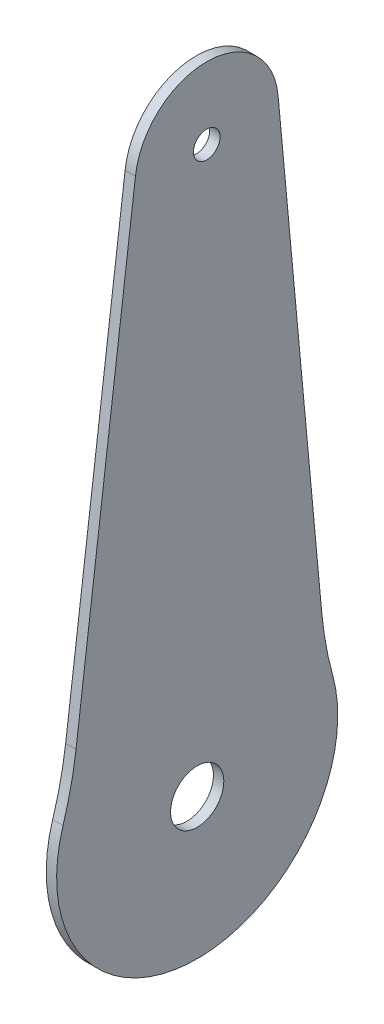
ISO-10303-21;
HEADER;
FILE_DESCRIPTION(('STEP AP214'),'2;1');
FILE_NAME('part.step','',(''),(''),'','','');
FILE_SCHEMA(('AUTOMOTIVE_DESIGN { 1 0 10303 214 1 1 1 1 }'));
ENDSEC;
DATA;
#1=APPLICATION_CONTEXT('core data for automotive mechanical design processes');
#2=APPLICATION_PROTOCOL_DEFINITION('international standard','automotive_design',2000,#1);
#3=PRODUCT_CONTEXT('',#1,'mechanical');
#4=PRODUCT('Part','Part','',(#3));
#5=PRODUCT_RELATED_PRODUCT_CATEGORY('part','',(#4));
#6=PRODUCT_DEFINITION_FORMATION('','',#4);
#7=PRODUCT_DEFINITION_CONTEXT('part definition',#1,'design');
#8=PRODUCT_DEFINITION('design','',#6,#7);
#9=PRODUCT_DEFINITION_SHAPE('','',#8);
#10=(LENGTH_UNIT() NAMED_UNIT(*) SI_UNIT(.MILLI.,.METRE.));
#11=(NAMED_UNIT(*) PLANE_ANGLE_UNIT() SI_UNIT($,.RADIAN.));
#12=(NAMED_UNIT(*) SI_UNIT($,.STERADIAN.) SOLID_ANGLE_UNIT());
#13=UNCERTAINTY_MEASURE_WITH_UNIT(LENGTH_MEASURE(1.E-05),#10,'distance_accuracy_value','');
#14=(GEOMETRIC_REPRESENTATION_CONTEXT(3) GLOBAL_UNCERTAINTY_ASSIGNED_CONTEXT((#13)) GLOBAL_UNIT_ASSIGNED_CONTEXT((#10,
#11,#12)) REPRESENTATION_CONTEXT('',''));
#15=CARTESIAN_POINT('',(0.,0.,0.));
#16=DIRECTION('',(0.,0.,1.));
#17=DIRECTION('',(1.,0.,0.));
#18=AXIS2_PLACEMENT_3D('',#15,#16,#17);
#19=CARTESIAN_POINT('',(1.5,-14.5197265267647,67.1222965585789));
#20=DIRECTION('',(-1.,0.,0.));
#21=DIRECTION('',(0.,0.,1.));
#22=AXIS2_PLACEMENT_3D('',#19,#20,#21);
#23=CYLINDRICAL_SURFACE('',#22,50.);
#24=CARTESIAN_POINT('',(0.,-14.5197265267647,67.1222965585789));
#25=DIRECTION('',(1.,0.,0.));
#26=DIRECTION('',(0.,0.,-1.));
#27=AXIS2_PLACEMENT_3D('',#24,#25,#26);
#28=CIRCLE('',#27,50.);
#29=CARTESIAN_POINT('',(0.,-29.4464687082596,19.4023597622337));
#30=VERTEX_POINT('',#29);
#31=CARTESIAN_POINT('',(0.,-20.8371614377476,17.5230020460004));
#32=VERTEX_POINT('',#31);
#33=EDGE_CURVE('E123',#30,#32,#28,.T.);
#34=ORIENTED_EDGE('',*,*,#33,.F.);
#35=DIRECTION('',(-1.,0.,0.));
#36=VECTOR('',#35,1.);
#37=CARTESIAN_POINT('',(1.5,-29.4464687082596,19.4023597622337));
#38=LINE('',#37,#36);
#39=CARTESIAN_POINT('',(1.5,-29.4464687082596,19.4023597622337));
#40=VERTEX_POINT('',#39);
#41=EDGE_CURVE('E11',#40,#30,#38,.T.);
#42=ORIENTED_EDGE('',*,*,#41,.F.);
#43=CARTESIAN_POINT('',(1.5,-14.5197265267647,67.1222965585789));
#44=DIRECTION('',(1.,0.,0.));
#45=DIRECTION('',(0.,0.,-1.));
#46=AXIS2_PLACEMENT_3D('',#43,#44,#45);
#47=CIRCLE('',#46,50.);
#48=CARTESIAN_POINT('',(1.5,-20.8371614377476,17.5230020460004));
#49=VERTEX_POINT('',#48);
#50=EDGE_CURVE('E142',#40,#49,#47,.T.);
#51=ORIENTED_EDGE('',*,*,#50,.T.);
#52=DIRECTION('',(-1.,0.,0.));
#53=VECTOR('',#52,1.);
#54=CARTESIAN_POINT('',(1.5,-20.8371614377476,17.5230020460004));
#55=LINE('',#54,#53);
#56=EDGE_CURVE('E78',#49,#32,#55,.T.);
#57=ORIENTED_EDGE('',*,*,#56,.T.);
#58=EDGE_LOOP('',(#34,#42,#51,#57));
#59=FACE_BOUND('',#58,.T.);
#60=ADVANCED_FACE('F34',(#59),#23,.F.);
#61=CARTESIAN_POINT('',(1.5,-35.5155048664515,0.));
#62=DIRECTION('',(-1.,0.,0.));
#63=DIRECTION('',(0.,0.,1.));
#64=AXIS2_PLACEMENT_3D('',#61,#62,#63);
#65=CYLINDRICAL_SURFACE('',#64,20.3294063915449);
#66=CARTESIAN_POINT('',(0.,-35.5155048664515,0.));
#67=DIRECTION('',(1.,0.,0.));
#68=DIRECTION('',(0.,0.,-1.));
#69=AXIS2_PLACEMENT_3D('',#66,#67,#68);
#70=CIRCLE('',#69,20.3294063915449);
#71=CARTESIAN_POINT('',(0.,-30.1098500353034,-19.5975421948537));
#72=VERTEX_POINT('',#71);
#73=EDGE_CURVE('E126',#30,#72,#70,.T.);
#74=ORIENTED_EDGE('',*,*,#73,.T.);
#75=DIRECTION('',(-1.,0.,0.));
#76=VECTOR('',#75,1.);
#77=CARTESIAN_POINT('',(1.5,-30.1098500353034,-19.5975421948537));
#78=LINE('',#77,#76);
#79=CARTESIAN_POINT('',(1.5,-30.1098500353034,-19.5975421948537));
#80=VERTEX_POINT('',#79);
#81=EDGE_CURVE('E42',#80,#72,#78,.T.);
#82=ORIENTED_EDGE('',*,*,#81,.F.);
#83=CARTESIAN_POINT('',(1.5,-35.5155048664515,0.));
#84=DIRECTION('',(1.,0.,0.));
#85=DIRECTION('',(0.,0.,-1.));
#86=AXIS2_PLACEMENT_3D('',#83,#84,#85);
#87=CIRCLE('',#86,20.3294063915449);
#88=EDGE_CURVE('E112',#40,#80,#87,.T.);
#89=ORIENTED_EDGE('',*,*,#88,.F.);
#90=ORIENTED_EDGE('',*,*,#41,.T.);
#91=EDGE_LOOP('',(#74,#82,#89,#90));
#92=FACE_BOUND('',#91,.T.);
#93=ADVANCED_FACE('F151',(#92),#65,.T.);
#94=CARTESIAN_POINT('',(1.5,-16.8146885164819,-67.7975285038606));
#95=DIRECTION('',(-1.,0.,0.));
#96=DIRECTION('',(0.,0.,1.));
#97=AXIS2_PLACEMENT_3D('',#94,#95,#96);
#98=CYLINDRICAL_SURFACE('',#97,50.);
#99=CARTESIAN_POINT('',(0.,-16.8146885164819,-67.7975285038606));
#100=DIRECTION('',(1.,0.,0.));
#101=DIRECTION('',(0.,0.,-1.));
#102=AXIS2_PLACEMENT_3D('',#99,#100,#101);
#103=CIRCLE('',#102,50.);
#104=CARTESIAN_POINT('',(0.,-21.4416066730812,-18.0120725114512));
#105=VERTEX_POINT('',#104);
#106=EDGE_CURVE('E129',#105,#72,#103,.T.);
#107=ORIENTED_EDGE('',*,*,#106,.F.);
#108=DIRECTION('',(-1.,0.,0.));
#109=VECTOR('',#108,1.);
#110=CARTESIAN_POINT('',(1.5,-21.4416066730812,-18.0120725114512));
#111=LINE('',#110,#109);
#112=CARTESIAN_POINT('',(1.5,-21.4416066730812,-18.0120725114512));
#113=VERTEX_POINT('',#112);
#114=EDGE_CURVE('E100',#113,#105,#111,.T.);
#115=ORIENTED_EDGE('',*,*,#114,.F.);
#116=CARTESIAN_POINT('',(1.5,-16.8146885164819,-67.7975285038606));
#117=DIRECTION('',(1.,0.,0.));
#118=DIRECTION('',(0.,0.,-1.));
#119=AXIS2_PLACEMENT_3D('',#116,#117,#118);
#120=CIRCLE('',#119,50.);
#121=EDGE_CURVE('E110',#113,#80,#120,.T.);
#122=ORIENTED_EDGE('',*,*,#121,.T.);
#123=ORIENTED_EDGE('',*,*,#81,.T.);
#124=EDGE_LOOP('',(#107,#115,#122,#123));
#125=FACE_BOUND('',#124,.T.);
#126=ADVANCED_FACE('F148',(#125),#98,.F.);
#127=CARTESIAN_POINT('',(1.5,1.47604368113649,-15.8821715109111));
#128=DIRECTION('',(0.,0.0925383631320308,-0.995709119848184));
#129=DIRECTION('',(0.,0.995709119848184,0.0925383631320308));
#130=AXIS2_PLACEMENT_3D('',#127,#128,#129);
#131=PLANE('',#130);
#132=DIRECTION('',(0.,-0.995709119848184,-0.0925383631320308));
#133=VECTOR('',#132,1.);
#134=CARTESIAN_POINT('',(0.,1.47604368113649,-15.8821715109111));
#135=LINE('',#134,#133);
#136=CARTESIAN_POINT('',(0.,46.2767379118723,-11.7185228823609));
#137=VERTEX_POINT('',#136);
#138=EDGE_CURVE('E99',#137,#105,#135,.T.);
#139=ORIENTED_EDGE('',*,*,#138,.F.);
#140=DIRECTION('',(-1.,0.,0.));
#141=VECTOR('',#140,1.);
#142=CARTESIAN_POINT('',(1.5,46.2767379118723,-11.7185228823609));
#143=LINE('',#142,#141);
#144=CARTESIAN_POINT('',(1.5,46.2767379118723,-11.7185228823609));
#145=VERTEX_POINT('',#144);
#146=EDGE_CURVE('E93',#145,#137,#143,.T.);
#147=ORIENTED_EDGE('',*,*,#146,.F.);
#148=DIRECTION('',(0.,-0.995709119848184,-0.0925383631320308));
#149=VECTOR('',#148,1.);
#150=CARTESIAN_POINT('',(1.5,1.47604368113649,-15.8821715109111));
#151=LINE('',#150,#149);
#152=EDGE_CURVE('E97',#145,#113,#151,.T.);
#153=ORIENTED_EDGE('',*,*,#152,.T.);
#154=ORIENTED_EDGE('',*,*,#114,.T.);
#155=EDGE_LOOP('',(#139,#147,#153,#154));
#156=FACE_BOUND('',#155,.T.);
#157=ADVANCED_FACE('F95',(#156),#131,.T.);
#158=CARTESIAN_POINT('',(1.5,45.4727796491909,-1.37759617231686));
#159=DIRECTION('',(-1.,0.,0.));
#160=DIRECTION('',(0.,0.,1.));
#161=AXIS2_PLACEMENT_3D('',#158,#159,#160);
#162=CYLINDRICAL_SURFACE('',#161,10.3721316088178);
#163=CARTESIAN_POINT('',(0.,45.4727796491909,-1.37759617231686));
#164=DIRECTION('',(1.,0.,0.));
#165=DIRECTION('',(0.,0.,-1.));
#166=AXIS2_PLACEMENT_3D('',#163,#164,#165);
#167=CIRCLE('',#166,10.3721316088178);
#168=CARTESIAN_POINT('',(0.,46.6279656765947,8.93000584525882));
#169=VERTEX_POINT('',#168);
#170=EDGE_CURVE('E71',#137,#169,#167,.T.);
#171=ORIENTED_EDGE('',*,*,#170,.T.);
#172=DIRECTION('',(-1.,0.,0.));
#173=VECTOR('',#172,1.);
#174=CARTESIAN_POINT('',(1.5,46.6279656765947,8.93000584525882));
#175=LINE('',#174,#173);
#176=CARTESIAN_POINT('',(1.5,46.6279656765947,8.93000584525882));
#177=VERTEX_POINT('',#176);
#178=EDGE_CURVE('E101',#177,#169,#175,.T.);
#179=ORIENTED_EDGE('',*,*,#178,.F.);
#180=CARTESIAN_POINT('',(1.5,45.4727796491909,-1.37759617231686));
#181=DIRECTION('',(1.,0.,0.));
#182=DIRECTION('',(0.,0.,-1.));
#183=AXIS2_PLACEMENT_3D('',#180,#181,#182);
#184=CIRCLE('',#183,10.3721316088178);
#185=EDGE_CURVE('E103',#145,#177,#184,.T.);
#186=ORIENTED_EDGE('',*,*,#185,.F.);
#187=ORIENTED_EDGE('',*,*,#146,.T.);
#188=EDGE_LOOP('',(#171,#179,#186,#187));
#189=FACE_BOUND('',#188,.T.);
#190=ADVANCED_FACE('F104',(#189),#162,.T.);
#191=CARTESIAN_POINT('',(1.5,45.4727796491909,-1.37759617231686));
#192=DIRECTION('',(-1.,0.,0.));
#193=DIRECTION('',(0.,0.,1.));
#194=AXIS2_PLACEMENT_3D('',#191,#192,#193);
#195=CYLINDRICAL_SURFACE('',#194,1.92500000001123);
#196=CARTESIAN_POINT('',(1.5,45.4727796491909,-1.37759617231686));
#197=DIRECTION('',(1.,0.,0.));
#198=DIRECTION('',(0.,0.,-1.));
#199=AXIS2_PLACEMENT_3D('',#196,#197,#198);
#200=CIRCLE('',#199,1.92500000001123);
#201=CARTESIAN_POINT('',(1.5,45.4727796491909,-3.30259617232809));
#202=VERTEX_POINT('',#201);
#203=EDGE_CURVE('E117',#202,#202,#200,.T.);
#204=ORIENTED_EDGE('',*,*,#203,.T.);
#205=EDGE_LOOP('',(#204));
#206=FACE_BOUND('',#205,.T.);
#207=CARTESIAN_POINT('',(0.,45.4727796491909,-1.37759617231686));
#208=DIRECTION('',(1.,0.,0.));
#209=DIRECTION('',(0.,0.,-1.));
#210=AXIS2_PLACEMENT_3D('',#207,#208,#209);
#211=CIRCLE('',#210,1.92500000001123);
#212=CARTESIAN_POINT('',(0.,45.4727796491909,-3.30259617232809));
#213=VERTEX_POINT('',#212);
#214=EDGE_CURVE('E136',#213,#213,#211,.T.);
#215=ORIENTED_EDGE('',*,*,#214,.F.);
#216=EDGE_LOOP('',(#215));
#217=FACE_BOUND('',#216,.T.);
#218=ADVANCED_FACE('F172',(#206,#217),#195,.F.);
#219=CARTESIAN_POINT('',(1.5,1.86362087970866,14.6316158654459));
#220=DIRECTION('',(0.,-0.12634869821966,-0.991985890251569));
#221=DIRECTION('',(0.,0.991985890251569,-0.12634869821966));
#222=AXIS2_PLACEMENT_3D('',#219,#220,#221);
#223=PLANE('',#222);
#224=DIRECTION('',(0.,-0.991985890251569,0.12634869821966));
#225=VECTOR('',#224,1.);
#226=CARTESIAN_POINT('',(0.,1.86362087970866,14.6316158654459));
#227=LINE('',#226,#225);
#228=EDGE_CURVE('E134',#169,#32,#227,.T.);
#229=ORIENTED_EDGE('',*,*,#228,.T.);
#230=ORIENTED_EDGE('',*,*,#56,.F.);
#231=DIRECTION('',(0.,-0.991985890251569,0.12634869821966));
#232=VECTOR('',#231,1.);
#233=CARTESIAN_POINT('',(1.5,1.86362087970866,14.6316158654459));
#234=LINE('',#233,#232);
#235=EDGE_CURVE('E50',#177,#49,#234,.T.);
#236=ORIENTED_EDGE('',*,*,#235,.F.);
#237=ORIENTED_EDGE('',*,*,#178,.T.);
#238=EDGE_LOOP('',(#229,#230,#236,#237));
#239=FACE_BOUND('',#238,.T.);
#240=ADVANCED_FACE('F157',(#239),#223,.F.);
#241=CARTESIAN_POINT('',(1.5,-35.5155048664515,0.));
#242=DIRECTION('',(-1.,0.,0.));
#243=DIRECTION('',(0.,0.,1.));
#244=AXIS2_PLACEMENT_3D('',#241,#242,#243);
#245=CYLINDRICAL_SURFACE('',#244,3.85);
#246=CARTESIAN_POINT('',(1.5,-35.5155048664515,0.));
#247=DIRECTION('',(1.,0.,0.));
#248=DIRECTION('',(0.,0.,-1.));
#249=AXIS2_PLACEMENT_3D('',#246,#247,#248);
#250=CIRCLE('',#249,3.85);
#251=CARTESIAN_POINT('',(1.5,-35.5155048664515,-3.85));
#252=VERTEX_POINT('',#251);
#253=EDGE_CURVE('E120',#252,#252,#250,.T.);
#254=ORIENTED_EDGE('',*,*,#253,.T.);
#255=EDGE_LOOP('',(#254));
#256=FACE_BOUND('',#255,.T.);
#257=CARTESIAN_POINT('',(0.,-35.5155048664515,0.));
#258=DIRECTION('',(1.,0.,0.));
#259=DIRECTION('',(0.,0.,-1.));
#260=AXIS2_PLACEMENT_3D('',#257,#258,#259);
#261=CIRCLE('',#260,3.85);
#262=CARTESIAN_POINT('',(0.,-35.5155048664515,-3.85));
#263=VERTEX_POINT('',#262);
#264=EDGE_CURVE('E139',#263,#263,#261,.T.);
#265=ORIENTED_EDGE('',*,*,#264,.F.);
#266=EDGE_LOOP('',(#265));
#267=FACE_BOUND('',#266,.T.);
#268=ADVANCED_FACE('F175',(#256,#267),#245,.F.);
#269=CARTESIAN_POINT('',(1.5,0.,0.));
#270=DIRECTION('',(1.,0.,0.));
#271=DIRECTION('',(0.,0.,-1.));
#272=AXIS2_PLACEMENT_3D('',#269,#270,#271);
#273=PLANE('',#272);
#274=ORIENTED_EDGE('',*,*,#50,.F.);
#275=ORIENTED_EDGE('',*,*,#88,.T.);
#276=ORIENTED_EDGE('',*,*,#121,.F.);
#277=ORIENTED_EDGE('',*,*,#152,.F.);
#278=ORIENTED_EDGE('',*,*,#185,.T.);
#279=ORIENTED_EDGE('',*,*,#235,.T.);
#280=EDGE_LOOP('',(#274,#275,#276,#277,#278,#279));
#281=FACE_BOUND('',#280,.T.);
#282=ORIENTED_EDGE('',*,*,#203,.F.);
#283=EDGE_LOOP('',(#282));
#284=FACE_BOUND('',#283,.T.);
#285=ORIENTED_EDGE('',*,*,#253,.F.);
#286=EDGE_LOOP('',(#285));
#287=FACE_BOUND('',#286,.T.);
#288=ADVANCED_FACE('F107',(#281,#284,#287),#273,.T.);
#289=CARTESIAN_POINT('',(0.,0.,0.));
#290=DIRECTION('',(1.,0.,0.));
#291=DIRECTION('',(0.,0.,-1.));
#292=AXIS2_PLACEMENT_3D('',#289,#290,#291);
#293=PLANE('',#292);
#294=ORIENTED_EDGE('',*,*,#33,.T.);
#295=ORIENTED_EDGE('',*,*,#228,.F.);
#296=ORIENTED_EDGE('',*,*,#170,.F.);
#297=ORIENTED_EDGE('',*,*,#138,.T.);
#298=ORIENTED_EDGE('',*,*,#106,.T.);
#299=ORIENTED_EDGE('',*,*,#73,.F.);
#300=EDGE_LOOP('',(#294,#295,#296,#297,#298,#299));
#301=FACE_BOUND('',#300,.T.);
#302=ORIENTED_EDGE('',*,*,#214,.T.);
#303=EDGE_LOOP('',(#302));
#304=FACE_BOUND('',#303,.T.);
#305=ORIENTED_EDGE('',*,*,#264,.T.);
#306=EDGE_LOOP('',(#305));
#307=FACE_BOUND('',#306,.T.);
#308=ADVANCED_FACE('F153',(#301,#304,#307),#293,.F.);
#309=CLOSED_SHELL('',(#60,#93,#126,#157,#190,#218,#240,#268,#288,#308));
#310=MANIFOLD_SOLID_BREP('B2',#309);
#311=ADVANCED_BREP_SHAPE_REPRESENTATION('',(#18,#310),#14);
#312=SHAPE_DEFINITION_REPRESENTATION(#9,#311);
ENDSEC;
END-ISO-10303-21;
